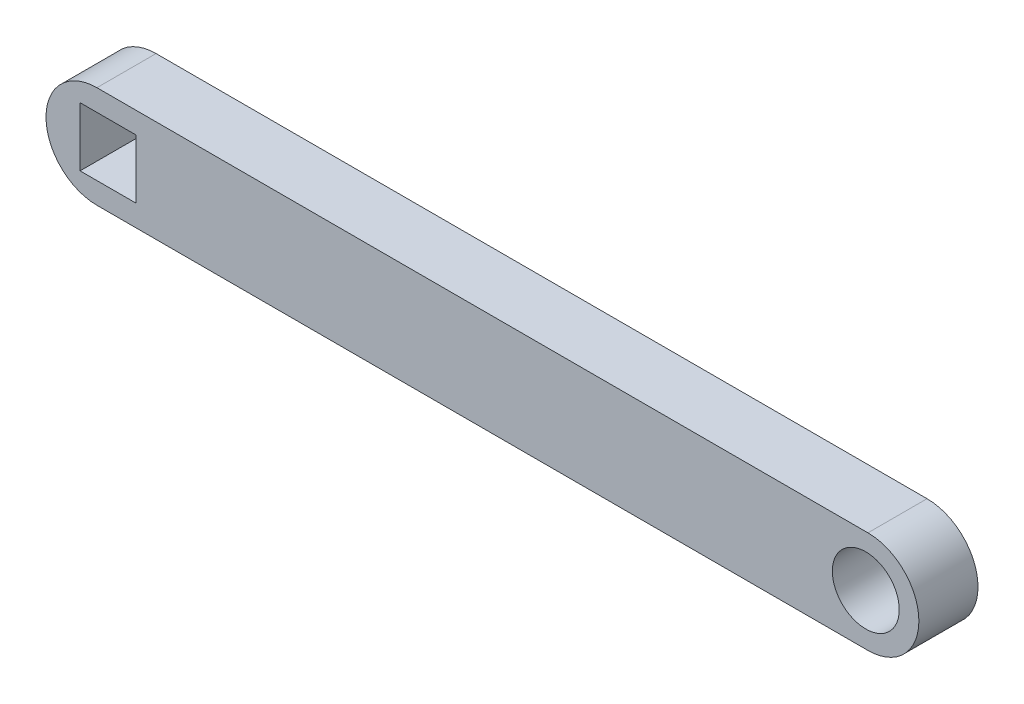
ISO-10303-21;
HEADER;
FILE_DESCRIPTION(('STEP AP214'),'2;1');
FILE_NAME('part.step','',(''),(''),'','','');
FILE_SCHEMA(('AUTOMOTIVE_DESIGN { 1 0 10303 214 1 1 1 1 }'));
ENDSEC;
DATA;
#1=APPLICATION_CONTEXT('core data for automotive mechanical design processes');
#2=APPLICATION_PROTOCOL_DEFINITION('international standard','automotive_design',2000,#1);
#3=PRODUCT_CONTEXT('',#1,'mechanical');
#4=PRODUCT('Part','Part','',(#3));
#5=PRODUCT_RELATED_PRODUCT_CATEGORY('part','',(#4));
#6=PRODUCT_DEFINITION_FORMATION('','',#4);
#7=PRODUCT_DEFINITION_CONTEXT('part definition',#1,'design');
#8=PRODUCT_DEFINITION('design','',#6,#7);
#9=PRODUCT_DEFINITION_SHAPE('','',#8);
#10=(LENGTH_UNIT() NAMED_UNIT(*) SI_UNIT(.MILLI.,.METRE.));
#11=(NAMED_UNIT(*) PLANE_ANGLE_UNIT() SI_UNIT($,.RADIAN.));
#12=(NAMED_UNIT(*) SI_UNIT($,.STERADIAN.) SOLID_ANGLE_UNIT());
#13=UNCERTAINTY_MEASURE_WITH_UNIT(LENGTH_MEASURE(1.E-05),#10,'distance_accuracy_value','');
#14=(GEOMETRIC_REPRESENTATION_CONTEXT(3) GLOBAL_UNCERTAINTY_ASSIGNED_CONTEXT((#13)) GLOBAL_UNIT_ASSIGNED_CONTEXT((#10,
#11,#12)) REPRESENTATION_CONTEXT('',''));
#15=CARTESIAN_POINT('',(0.,0.,0.));
#16=DIRECTION('',(0.,0.,1.));
#17=DIRECTION('',(1.,0.,0.));
#18=AXIS2_PLACEMENT_3D('',#15,#16,#17);
#19=CARTESIAN_POINT('',(36.2859638617368,0.,3.5));
#20=DIRECTION('',(0.,0.,1.));
#21=DIRECTION('',(1.,0.,0.));
#22=AXIS2_PLACEMENT_3D('',#19,#20,#21);
#23=PLANE('',#22);
#24=CARTESIAN_POINT('',(36.2859638617368,0.,3.5));
#25=DIRECTION('',(0.,0.,1.));
#26=DIRECTION('',(1.,0.,0.));
#27=AXIS2_PLACEMENT_3D('',#24,#25,#26);
#28=CIRCLE('',#27,2.66614433991993);
#29=CARTESIAN_POINT('',(36.2859638617368,-2.66614433991993,3.5));
#30=VERTEX_POINT('',#29);
#31=CARTESIAN_POINT('',(36.2859638617368,2.66614433991993,3.5));
#32=VERTEX_POINT('',#31);
#33=EDGE_CURVE('E104',#30,#32,#28,.T.);
#34=ORIENTED_EDGE('',*,*,#33,.T.);
#35=DIRECTION('',(1.,0.,0.));
#36=VECTOR('',#35,1.);
#37=CARTESIAN_POINT('',(-43.5993578718037,2.66614433991993,3.5));
#38=LINE('',#37,#36);
#39=CARTESIAN_POINT('',(-31.0193688082418,2.66614433991993,3.5));
#40=VERTEX_POINT('',#39);
#41=EDGE_CURVE('E110',#40,#32,#38,.T.);
#42=ORIENTED_EDGE('',*,*,#41,.F.);
#43=CARTESIAN_POINT('',(-31.0193688082418,0.,3.5));
#44=DIRECTION('',(0.,0.,1.));
#45=DIRECTION('',(1.,0.,0.));
#46=AXIS2_PLACEMENT_3D('',#43,#44,#45);
#47=CIRCLE('',#46,2.66614433991993);
#48=CARTESIAN_POINT('',(-31.0193688082418,-2.66614433991993,3.5));
#49=VERTEX_POINT('',#48);
#50=EDGE_CURVE('E116',#40,#49,#47,.T.);
#51=ORIENTED_EDGE('',*,*,#50,.T.);
#52=DIRECTION('',(-1.,0.,0.));
#53=VECTOR('',#52,1.);
#54=CARTESIAN_POINT('',(-43.5993578718037,-2.66614433991993,3.5));
#55=LINE('',#54,#53);
#56=EDGE_CURVE('E108',#30,#49,#55,.T.);
#57=ORIENTED_EDGE('',*,*,#56,.F.);
#58=EDGE_LOOP('',(#34,#42,#51,#57));
#59=FACE_BOUND('',#58,.T.);
#60=ADVANCED_FACE('F62',(#59),#23,.T.);
#61=CARTESIAN_POINT('',(-43.5993578718037,2.66614433991993,-76.3330785970548));
#62=DIRECTION('',(0.,-1.,0.));
#63=DIRECTION('',(0.,0.,-1.));
#64=AXIS2_PLACEMENT_3D('',#61,#62,#63);
#65=PLANE('',#64);
#66=DIRECTION('',(0.,0.,1.));
#67=VECTOR('',#66,1.);
#68=CARTESIAN_POINT('',(36.2859638617368,2.66614433991993,-76.3330785970548));
#69=LINE('',#68,#67);
#70=CARTESIAN_POINT('',(36.2859638617368,2.66614433991993,1.5));
#71=VERTEX_POINT('',#70);
#72=EDGE_CURVE('E101',#71,#32,#69,.T.);
#73=ORIENTED_EDGE('',*,*,#72,.F.);
#74=DIRECTION('',(-1.,0.,0.));
#75=VECTOR('',#74,1.);
#76=CARTESIAN_POINT('',(-43.5993578718037,2.66614433991993,1.5));
#77=LINE('',#76,#75);
#78=CARTESIAN_POINT('',(-31.0193688082418,2.66614433991993,1.49999999999997));
#79=VERTEX_POINT('',#78);
#80=EDGE_CURVE('E66',#71,#79,#77,.T.);
#81=ORIENTED_EDGE('',*,*,#80,.T.);
#82=DIRECTION('',(0.,0.,1.));
#83=VECTOR('',#82,1.);
#84=CARTESIAN_POINT('',(-31.0193688082418,2.66614433991993,-76.3330785970548));
#85=LINE('',#84,#83);
#86=EDGE_CURVE('E107',#79,#40,#85,.T.);
#87=ORIENTED_EDGE('',*,*,#86,.T.);
#88=ORIENTED_EDGE('',*,*,#41,.T.);
#89=EDGE_LOOP('',(#73,#81,#87,#88));
#90=FACE_BOUND('',#89,.T.);
#91=ADVANCED_FACE('F111',(#90),#65,.F.);
#92=CARTESIAN_POINT('',(-31.0193688082418,0.,-76.3330785970548));
#93=DIRECTION('',(0.,0.,1.));
#94=DIRECTION('',(1.,0.,0.));
#95=AXIS2_PLACEMENT_3D('',#92,#93,#94);
#96=CYLINDRICAL_SURFACE('',#95,2.66614433991993);
#97=CARTESIAN_POINT('',(-31.0193688082418,0.,1.5));
#98=DIRECTION('',(0.,0.,1.));
#99=DIRECTION('',(1.,0.,0.));
#100=AXIS2_PLACEMENT_3D('',#97,#98,#99);
#101=CIRCLE('',#100,2.66614433991993);
#102=CARTESIAN_POINT('',(-31.0193688082418,-2.66614433991993,1.5));
#103=VERTEX_POINT('',#102);
#104=EDGE_CURVE('E132',#103,#79,#101,.F.);
#105=ORIENTED_EDGE('',*,*,#104,.F.);
#106=DIRECTION('',(0.,0.,1.));
#107=VECTOR('',#106,1.);
#108=CARTESIAN_POINT('',(-31.0193688082418,-2.66614433991993,-76.3330785970548));
#109=LINE('',#108,#107);
#110=EDGE_CURVE('E127',#103,#49,#109,.T.);
#111=ORIENTED_EDGE('',*,*,#110,.T.);
#112=ORIENTED_EDGE('',*,*,#50,.F.);
#113=ORIENTED_EDGE('',*,*,#86,.F.);
#114=EDGE_LOOP('',(#105,#111,#112,#113));
#115=FACE_BOUND('',#114,.T.);
#116=ADVANCED_FACE('F131',(#115),#96,.T.);
#117=CARTESIAN_POINT('',(-43.5993578718037,-2.66614433991993,-76.3330785970548));
#118=DIRECTION('',(0.,1.,0.));
#119=DIRECTION('',(0.,0.,1.));
#120=AXIS2_PLACEMENT_3D('',#117,#118,#119);
#121=PLANE('',#120);
#122=ORIENTED_EDGE('',*,*,#110,.F.);
#123=DIRECTION('',(1.,0.,0.));
#124=VECTOR('',#123,1.);
#125=CARTESIAN_POINT('',(-43.5993578718037,-2.66614433991993,1.5));
#126=LINE('',#125,#124);
#127=CARTESIAN_POINT('',(36.2859638617368,-2.66614433991993,1.5));
#128=VERTEX_POINT('',#127);
#129=EDGE_CURVE('E71',#103,#128,#126,.T.);
#130=ORIENTED_EDGE('',*,*,#129,.T.);
#131=DIRECTION('',(0.,0.,1.));
#132=VECTOR('',#131,1.);
#133=CARTESIAN_POINT('',(36.2859638617368,-2.66614433991993,-76.3330785970548));
#134=LINE('',#133,#132);
#135=EDGE_CURVE('E125',#128,#30,#134,.T.);
#136=ORIENTED_EDGE('',*,*,#135,.T.);
#137=ORIENTED_EDGE('',*,*,#56,.T.);
#138=EDGE_LOOP('',(#122,#130,#136,#137));
#139=FACE_BOUND('',#138,.T.);
#140=ADVANCED_FACE('F134',(#139),#121,.F.);
#141=CARTESIAN_POINT('',(36.2859638617368,0.,-76.3330785970548));
#142=DIRECTION('',(0.,0.,1.));
#143=DIRECTION('',(1.,0.,0.));
#144=AXIS2_PLACEMENT_3D('',#141,#142,#143);
#145=CYLINDRICAL_SURFACE('',#144,2.66614433991993);
#146=CARTESIAN_POINT('',(36.2859638617368,0.,1.5));
#147=DIRECTION('',(0.,0.,1.));
#148=DIRECTION('',(1.,0.,0.));
#149=AXIS2_PLACEMENT_3D('',#146,#147,#148);
#150=CIRCLE('',#149,2.66614433991993);
#151=EDGE_CURVE('E14',#71,#128,#150,.F.);
#152=ORIENTED_EDGE('',*,*,#151,.F.);
#153=ORIENTED_EDGE('',*,*,#72,.T.);
#154=ORIENTED_EDGE('',*,*,#33,.F.);
#155=ORIENTED_EDGE('',*,*,#135,.F.);
#156=EDGE_LOOP('',(#152,#153,#154,#155));
#157=FACE_BOUND('',#156,.T.);
#158=ADVANCED_FACE('F64',(#157),#145,.T.);
#159=CARTESIAN_POINT('',(-43.5993578718037,0.,1.5));
#160=DIRECTION('',(0.,0.,1.));
#161=DIRECTION('',(1.,0.,0.));
#162=AXIS2_PLACEMENT_3D('',#159,#160,#161);
#163=PLANE('',#162);
#164=ORIENTED_EDGE('',*,*,#151,.T.);
#165=ORIENTED_EDGE('',*,*,#129,.F.);
#166=ORIENTED_EDGE('',*,*,#104,.T.);
#167=ORIENTED_EDGE('',*,*,#80,.F.);
#168=EDGE_LOOP('',(#164,#165,#166,#167));
#169=FACE_BOUND('',#168,.T.);
#170=ADVANCED_FACE('F136',(#169),#163,.F.);
#171=CLOSED_SHELL('',(#60,#91,#116,#140,#158,#170));
#172=MANIFOLD_SOLID_BREP('B2',#171);
#173=CARTESIAN_POINT('',(-43.5993578718037,0.,3.5));
#174=DIRECTION('',(0.,0.,-1.));
#175=DIRECTION('',(-1.,0.,0.));
#176=AXIS2_PLACEMENT_3D('',#173,#174,#175);
#177=CYLINDRICAL_SURFACE('',#176,6.02969842907924);
#178=CARTESIAN_POINT('',(-43.5993578718037,0.,-3.5));
#179=DIRECTION('',(0.,0.,1.));
#180=DIRECTION('',(1.,0.,0.));
#181=AXIS2_PLACEMENT_3D('',#178,#179,#180);
#182=CIRCLE('',#181,6.02969842907924);
#183=CARTESIAN_POINT('',(-43.5993578718037,6.02969842907924,-3.5));
#184=VERTEX_POINT('',#183);
#185=CARTESIAN_POINT('',(-43.5993578718037,-6.02969842907924,-3.5));
#186=VERTEX_POINT('',#185);
#187=EDGE_CURVE('E301',#184,#186,#182,.T.);
#188=ORIENTED_EDGE('',*,*,#187,.T.);
#189=DIRECTION('',(0.,0.,-1.));
#190=VECTOR('',#189,1.);
#191=CARTESIAN_POINT('',(-43.5993578718037,-6.02969842907924,3.5));
#192=LINE('',#191,#190);
#193=CARTESIAN_POINT('',(-43.5993578718037,-6.02969842907924,3.5));
#194=VERTEX_POINT('',#193);
#195=EDGE_CURVE('E60',#194,#186,#192,.T.);
#196=ORIENTED_EDGE('',*,*,#195,.F.);
#197=CARTESIAN_POINT('',(-43.5993578718037,0.,3.5));
#198=DIRECTION('',(0.,0.,1.));
#199=DIRECTION('',(1.,0.,0.));
#200=AXIS2_PLACEMENT_3D('',#197,#198,#199);
#201=CIRCLE('',#200,6.02969842907924);
#202=CARTESIAN_POINT('',(-43.5993578718037,6.02969842907924,3.5));
#203=VERTEX_POINT('',#202);
#204=EDGE_CURVE('E302',#203,#194,#201,.T.);
#205=ORIENTED_EDGE('',*,*,#204,.F.);
#206=DIRECTION('',(0.,0.,-1.));
#207=VECTOR('',#206,1.);
#208=CARTESIAN_POINT('',(-43.5993578718037,6.02969842907924,3.5));
#209=LINE('',#208,#207);
#210=EDGE_CURVE('E312',#203,#184,#209,.T.);
#211=ORIENTED_EDGE('',*,*,#210,.T.);
#212=EDGE_LOOP('',(#188,#196,#205,#211));
#213=FACE_BOUND('',#212,.T.);
#214=ADVANCED_FACE('F195',(#213),#177,.T.);
#215=CARTESIAN_POINT('',(-43.5993578718037,-6.02969842907924,3.5));
#216=DIRECTION('',(0.,1.,0.));
#217=DIRECTION('',(0.,0.,1.));
#218=AXIS2_PLACEMENT_3D('',#215,#216,#217);
#219=PLANE('',#218);
#220=DIRECTION('',(1.,0.,0.));
#221=VECTOR('',#220,1.);
#222=CARTESIAN_POINT('',(-43.5993578718037,-6.02969842907924,-3.5));
#223=LINE('',#222,#221);
#224=CARTESIAN_POINT('',(47.6809998853343,-6.02969842907924,-3.5));
#225=VERTEX_POINT('',#224);
#226=EDGE_CURVE('E315',#186,#225,#223,.T.);
#227=ORIENTED_EDGE('',*,*,#226,.T.);
#228=DIRECTION('',(0.,0.,-1.));
#229=VECTOR('',#228,1.);
#230=CARTESIAN_POINT('',(47.6809998853343,-6.02969842907924,3.5));
#231=LINE('',#230,#229);
#232=CARTESIAN_POINT('',(47.6809998853343,-6.02969842907924,3.5));
#233=VERTEX_POINT('',#232);
#234=EDGE_CURVE('E202',#233,#225,#231,.T.);
#235=ORIENTED_EDGE('',*,*,#234,.F.);
#236=DIRECTION('',(1.,0.,0.));
#237=VECTOR('',#236,1.);
#238=CARTESIAN_POINT('',(-43.5993578718037,-6.02969842907924,3.5));
#239=LINE('',#238,#237);
#240=EDGE_CURVE('E305',#194,#233,#239,.T.);
#241=ORIENTED_EDGE('',*,*,#240,.F.);
#242=ORIENTED_EDGE('',*,*,#195,.T.);
#243=EDGE_LOOP('',(#227,#235,#241,#242));
#244=FACE_BOUND('',#243,.T.);
#245=ADVANCED_FACE('F344',(#244),#219,.F.);
#246=CARTESIAN_POINT('',(47.6809998853343,0.,3.5));
#247=DIRECTION('',(0.,0.,-1.));
#248=DIRECTION('',(-1.,0.,0.));
#249=AXIS2_PLACEMENT_3D('',#246,#247,#248);
#250=CYLINDRICAL_SURFACE('',#249,6.02969842907924);
#251=CARTESIAN_POINT('',(47.6809998853343,0.,-3.5));
#252=DIRECTION('',(0.,0.,1.));
#253=DIRECTION('',(1.,0.,0.));
#254=AXIS2_PLACEMENT_3D('',#251,#252,#253);
#255=CIRCLE('',#254,6.02969842907924);
#256=CARTESIAN_POINT('',(47.6809998853343,6.02969842907924,-3.5));
#257=VERTEX_POINT('',#256);
#258=EDGE_CURVE('E317',#225,#257,#255,.T.);
#259=ORIENTED_EDGE('',*,*,#258,.T.);
#260=DIRECTION('',(0.,0.,-1.));
#261=VECTOR('',#260,1.);
#262=CARTESIAN_POINT('',(47.6809998853343,6.02969842907924,3.5));
#263=LINE('',#262,#261);
#264=CARTESIAN_POINT('',(47.6809998853343,6.02969842907924,3.5));
#265=VERTEX_POINT('',#264);
#266=EDGE_CURVE('E322',#265,#257,#263,.T.);
#267=ORIENTED_EDGE('',*,*,#266,.F.);
#268=CARTESIAN_POINT('',(47.6809998853343,0.,3.5));
#269=DIRECTION('',(0.,0.,1.));
#270=DIRECTION('',(1.,0.,0.));
#271=AXIS2_PLACEMENT_3D('',#268,#269,#270);
#272=CIRCLE('',#271,6.02969842907924);
#273=EDGE_CURVE('E308',#233,#265,#272,.T.);
#274=ORIENTED_EDGE('',*,*,#273,.F.);
#275=ORIENTED_EDGE('',*,*,#234,.T.);
#276=EDGE_LOOP('',(#259,#267,#274,#275));
#277=FACE_BOUND('',#276,.T.);
#278=ADVANCED_FACE('F329',(#277),#250,.T.);
#279=CARTESIAN_POINT('',(-43.5993578718037,6.02969842907924,3.5));
#280=DIRECTION('',(0.,-1.,0.));
#281=DIRECTION('',(0.,0.,-1.));
#282=AXIS2_PLACEMENT_3D('',#279,#280,#281);
#283=PLANE('',#282);
#284=DIRECTION('',(-1.,0.,0.));
#285=VECTOR('',#284,1.);
#286=CARTESIAN_POINT('',(-43.5993578718037,6.02969842907924,-3.5));
#287=LINE('',#286,#285);
#288=EDGE_CURVE('E306',#257,#184,#287,.T.);
#289=ORIENTED_EDGE('',*,*,#288,.T.);
#290=ORIENTED_EDGE('',*,*,#210,.F.);
#291=DIRECTION('',(-1.,0.,0.));
#292=VECTOR('',#291,1.);
#293=CARTESIAN_POINT('',(-43.5993578718037,6.02969842907924,3.5));
#294=LINE('',#293,#292);
#295=EDGE_CURVE('E310',#265,#203,#294,.T.);
#296=ORIENTED_EDGE('',*,*,#295,.F.);
#297=ORIENTED_EDGE('',*,*,#266,.T.);
#298=EDGE_LOOP('',(#289,#290,#296,#297));
#299=FACE_BOUND('',#298,.T.);
#300=ADVANCED_FACE('F338',(#299),#283,.F.);
#301=CARTESIAN_POINT('',(-43.5993578718037,0.,3.5));
#302=DIRECTION('',(0.,0.,1.));
#303=DIRECTION('',(1.,0.,0.));
#304=AXIS2_PLACEMENT_3D('',#301,#302,#303);
#305=PLANE('',#304);
#306=DIRECTION('',(0.,-1.,0.));
#307=VECTOR('',#306,1.);
#308=CARTESIAN_POINT('',(-45.5942911998041,-3.49561146789502,3.5));
#309=LINE('',#308,#307);
#310=CARTESIAN_POINT('',(-45.5942911998041,3.49561146789502,3.5));
#311=VERTEX_POINT('',#310);
#312=CARTESIAN_POINT('',(-45.5942911998041,-3.49561146789502,3.5));
#313=VERTEX_POINT('',#312);
#314=EDGE_CURVE('E209',#311,#313,#309,.T.);
#315=ORIENTED_EDGE('',*,*,#314,.F.);
#316=DIRECTION('',(-1.,0.,0.));
#317=VECTOR('',#316,1.);
#318=CARTESIAN_POINT('',(-38.9585541760034,3.49561146789502,3.5));
#319=LINE('',#318,#317);
#320=CARTESIAN_POINT('',(-38.9585541760034,3.49561146789502,3.5));
#321=VERTEX_POINT('',#320);
#322=EDGE_CURVE('E277',#321,#311,#319,.T.);
#323=ORIENTED_EDGE('',*,*,#322,.F.);
#324=DIRECTION('',(0.,1.,0.));
#325=VECTOR('',#324,1.);
#326=CARTESIAN_POINT('',(-38.9585541760034,-3.49561146789502,3.5));
#327=LINE('',#326,#325);
#328=CARTESIAN_POINT('',(-38.9585541760034,-3.49561146789502,3.5));
#329=VERTEX_POINT('',#328);
#330=EDGE_CURVE('E261',#329,#321,#327,.T.);
#331=ORIENTED_EDGE('',*,*,#330,.F.);
#332=DIRECTION('',(1.,0.,0.));
#333=VECTOR('',#332,1.);
#334=CARTESIAN_POINT('',(-38.9585541760034,-3.49561146789502,3.5));
#335=LINE('',#334,#333);
#336=EDGE_CURVE('E270',#313,#329,#335,.T.);
#337=ORIENTED_EDGE('',*,*,#336,.F.);
#338=EDGE_LOOP('',(#315,#323,#331,#337));
#339=FACE_BOUND('',#338,.T.);
#340=CARTESIAN_POINT('',(47.4245224374023,0.,3.5));
#341=DIRECTION('',(0.,0.,1.));
#342=DIRECTION('',(1.,0.,0.));
#343=AXIS2_PLACEMENT_3D('',#340,#341,#342);
#344=CIRCLE('',#343,3.96073987918595);
#345=CARTESIAN_POINT('',(51.3852623165883,0.,3.5));
#346=VERTEX_POINT('',#345);
#347=EDGE_CURVE('E293',#346,#346,#344,.T.);
#348=ORIENTED_EDGE('',*,*,#347,.F.);
#349=EDGE_LOOP('',(#348));
#350=FACE_BOUND('',#349,.T.);
#351=ORIENTED_EDGE('',*,*,#204,.T.);
#352=ORIENTED_EDGE('',*,*,#240,.T.);
#353=ORIENTED_EDGE('',*,*,#273,.T.);
#354=ORIENTED_EDGE('',*,*,#295,.T.);
#355=EDGE_LOOP('',(#351,#352,#353,#354));
#356=FACE_BOUND('',#355,.T.);
#357=ADVANCED_FACE('F274',(#339,#350,#356),#305,.T.);
#358=CARTESIAN_POINT('',(-43.5993578718037,0.,-3.5));
#359=DIRECTION('',(0.,0.,1.));
#360=DIRECTION('',(1.,0.,0.));
#361=AXIS2_PLACEMENT_3D('',#358,#359,#360);
#362=PLANE('',#361);
#363=DIRECTION('',(-1.,0.,0.));
#364=VECTOR('',#363,1.);
#365=CARTESIAN_POINT('',(-38.9585541760034,3.49561146789502,-3.5));
#366=LINE('',#365,#364);
#367=CARTESIAN_POINT('',(-38.9585541760034,3.49561146789502,-3.5));
#368=VERTEX_POINT('',#367);
#369=CARTESIAN_POINT('',(-45.5942911998041,3.49561146789502,-3.5));
#370=VERTEX_POINT('',#369);
#371=EDGE_CURVE('E288',#368,#370,#366,.T.);
#372=ORIENTED_EDGE('',*,*,#371,.T.);
#373=DIRECTION('',(0.,-1.,0.));
#374=VECTOR('',#373,1.);
#375=CARTESIAN_POINT('',(-45.5942911998041,-3.49561146789502,-3.5));
#376=LINE('',#375,#374);
#377=CARTESIAN_POINT('',(-45.5942911998041,-3.49561146789502,-3.5));
#378=VERTEX_POINT('',#377);
#379=EDGE_CURVE('E279',#370,#378,#376,.T.);
#380=ORIENTED_EDGE('',*,*,#379,.T.);
#381=DIRECTION('',(1.,0.,0.));
#382=VECTOR('',#381,1.);
#383=CARTESIAN_POINT('',(-38.9585541760034,-3.49561146789502,-3.5));
#384=LINE('',#383,#382);
#385=CARTESIAN_POINT('',(-38.9585541760034,-3.49561146789502,-3.5));
#386=VERTEX_POINT('',#385);
#387=EDGE_CURVE('E285',#378,#386,#384,.T.);
#388=ORIENTED_EDGE('',*,*,#387,.T.);
#389=DIRECTION('',(0.,1.,0.));
#390=VECTOR('',#389,1.);
#391=CARTESIAN_POINT('',(-38.9585541760034,-3.49561146789502,-3.5));
#392=LINE('',#391,#390);
#393=EDGE_CURVE('E217',#386,#368,#392,.T.);
#394=ORIENTED_EDGE('',*,*,#393,.T.);
#395=EDGE_LOOP('',(#372,#380,#388,#394));
#396=FACE_BOUND('',#395,.T.);
#397=CARTESIAN_POINT('',(47.4245224374023,0.,-3.5));
#398=DIRECTION('',(0.,0.,1.));
#399=DIRECTION('',(1.,0.,0.));
#400=AXIS2_PLACEMENT_3D('',#397,#398,#399);
#401=CIRCLE('',#400,3.96073987918595);
#402=CARTESIAN_POINT('',(51.3852623165883,0.,-3.5));
#403=VERTEX_POINT('',#402);
#404=EDGE_CURVE('E298',#403,#403,#401,.T.);
#405=ORIENTED_EDGE('',*,*,#404,.T.);
#406=EDGE_LOOP('',(#405));
#407=FACE_BOUND('',#406,.T.);
#408=ORIENTED_EDGE('',*,*,#187,.F.);
#409=ORIENTED_EDGE('',*,*,#288,.F.);
#410=ORIENTED_EDGE('',*,*,#258,.F.);
#411=ORIENTED_EDGE('',*,*,#226,.F.);
#412=EDGE_LOOP('',(#408,#409,#410,#411));
#413=FACE_BOUND('',#412,.T.);
#414=ADVANCED_FACE('F335',(#396,#407,#413),#362,.F.);
#415=CARTESIAN_POINT('',(47.4245224374023,0.,-3.5));
#416=DIRECTION('',(0.,0.,1.));
#417=DIRECTION('',(1.,0.,0.));
#418=AXIS2_PLACEMENT_3D('',#415,#416,#417);
#419=CYLINDRICAL_SURFACE('',#418,3.96073987918595);
#420=ORIENTED_EDGE('',*,*,#404,.F.);
#421=EDGE_LOOP('',(#420));
#422=FACE_BOUND('',#421,.T.);
#423=ORIENTED_EDGE('',*,*,#347,.T.);
#424=EDGE_LOOP('',(#423));
#425=FACE_BOUND('',#424,.T.);
#426=ADVANCED_FACE('F356',(#422,#425),#419,.F.);
#427=CARTESIAN_POINT('',(-45.5942911998041,-3.49561146789502,-3.5));
#428=DIRECTION('',(-1.,0.,0.));
#429=DIRECTION('',(0.,0.,1.));
#430=AXIS2_PLACEMENT_3D('',#427,#428,#429);
#431=PLANE('',#430);
#432=DIRECTION('',(0.,0.,1.));
#433=VECTOR('',#432,1.);
#434=CARTESIAN_POINT('',(-45.5942911998041,-3.49561146789502,-3.5));
#435=LINE('',#434,#433);
#436=EDGE_CURVE('E267',#378,#313,#435,.T.);
#437=ORIENTED_EDGE('',*,*,#436,.F.);
#438=ORIENTED_EDGE('',*,*,#379,.F.);
#439=DIRECTION('',(0.,0.,1.));
#440=VECTOR('',#439,1.);
#441=CARTESIAN_POINT('',(-45.5942911998041,3.49561146789502,-3.5));
#442=LINE('',#441,#440);
#443=EDGE_CURVE('E291',#370,#311,#442,.T.);
#444=ORIENTED_EDGE('',*,*,#443,.T.);
#445=ORIENTED_EDGE('',*,*,#314,.T.);
#446=EDGE_LOOP('',(#437,#438,#444,#445));
#447=FACE_BOUND('',#446,.T.);
#448=ADVANCED_FACE('F362',(#447),#431,.F.);
#449=CARTESIAN_POINT('',(-38.9585541760034,3.49561146789502,-3.5));
#450=DIRECTION('',(0.,1.,0.));
#451=DIRECTION('',(0.,0.,1.));
#452=AXIS2_PLACEMENT_3D('',#449,#450,#451);
#453=PLANE('',#452);
#454=ORIENTED_EDGE('',*,*,#443,.F.);
#455=ORIENTED_EDGE('',*,*,#371,.F.);
#456=DIRECTION('',(0.,0.,1.));
#457=VECTOR('',#456,1.);
#458=CARTESIAN_POINT('',(-38.9585541760034,3.49561146789502,-3.5));
#459=LINE('',#458,#457);
#460=EDGE_CURVE('E266',#368,#321,#459,.T.);
#461=ORIENTED_EDGE('',*,*,#460,.T.);
#462=ORIENTED_EDGE('',*,*,#322,.T.);
#463=EDGE_LOOP('',(#454,#455,#461,#462));
#464=FACE_BOUND('',#463,.T.);
#465=ADVANCED_FACE('F366',(#464),#453,.F.);
#466=CARTESIAN_POINT('',(-38.9585541760034,-3.49561146789502,-3.5));
#467=DIRECTION('',(1.,0.,0.));
#468=DIRECTION('',(0.,0.,-1.));
#469=AXIS2_PLACEMENT_3D('',#466,#467,#468);
#470=PLANE('',#469);
#471=ORIENTED_EDGE('',*,*,#460,.F.);
#472=ORIENTED_EDGE('',*,*,#393,.F.);
#473=DIRECTION('',(0.,0.,1.));
#474=VECTOR('',#473,1.);
#475=CARTESIAN_POINT('',(-38.9585541760034,-3.49561146789502,-3.5));
#476=LINE('',#475,#474);
#477=EDGE_CURVE('E257',#386,#329,#476,.T.);
#478=ORIENTED_EDGE('',*,*,#477,.T.);
#479=ORIENTED_EDGE('',*,*,#330,.T.);
#480=EDGE_LOOP('',(#471,#472,#478,#479));
#481=FACE_BOUND('',#480,.T.);
#482=ADVANCED_FACE('F259',(#481),#470,.F.);
#483=CARTESIAN_POINT('',(-38.9585541760034,-3.49561146789502,-3.5));
#484=DIRECTION('',(0.,-1.,0.));
#485=DIRECTION('',(0.,0.,-1.));
#486=AXIS2_PLACEMENT_3D('',#483,#484,#485);
#487=PLANE('',#486);
#488=ORIENTED_EDGE('',*,*,#477,.F.);
#489=ORIENTED_EDGE('',*,*,#387,.F.);
#490=ORIENTED_EDGE('',*,*,#436,.T.);
#491=ORIENTED_EDGE('',*,*,#336,.T.);
#492=EDGE_LOOP('',(#488,#489,#490,#491));
#493=FACE_BOUND('',#492,.T.);
#494=ADVANCED_FACE('F271',(#493),#487,.F.);
#495=CLOSED_SHELL('',(#214,#245,#278,#300,#357,#414,#426,#448,#465,#482,#494));
#496=MANIFOLD_SOLID_BREP('B8',#495);
#497=ADVANCED_BREP_SHAPE_REPRESENTATION('',(#18,#172,#496),#14);
#498=SHAPE_DEFINITION_REPRESENTATION(#9,#497);
ENDSEC;
END-ISO-10303-21;
